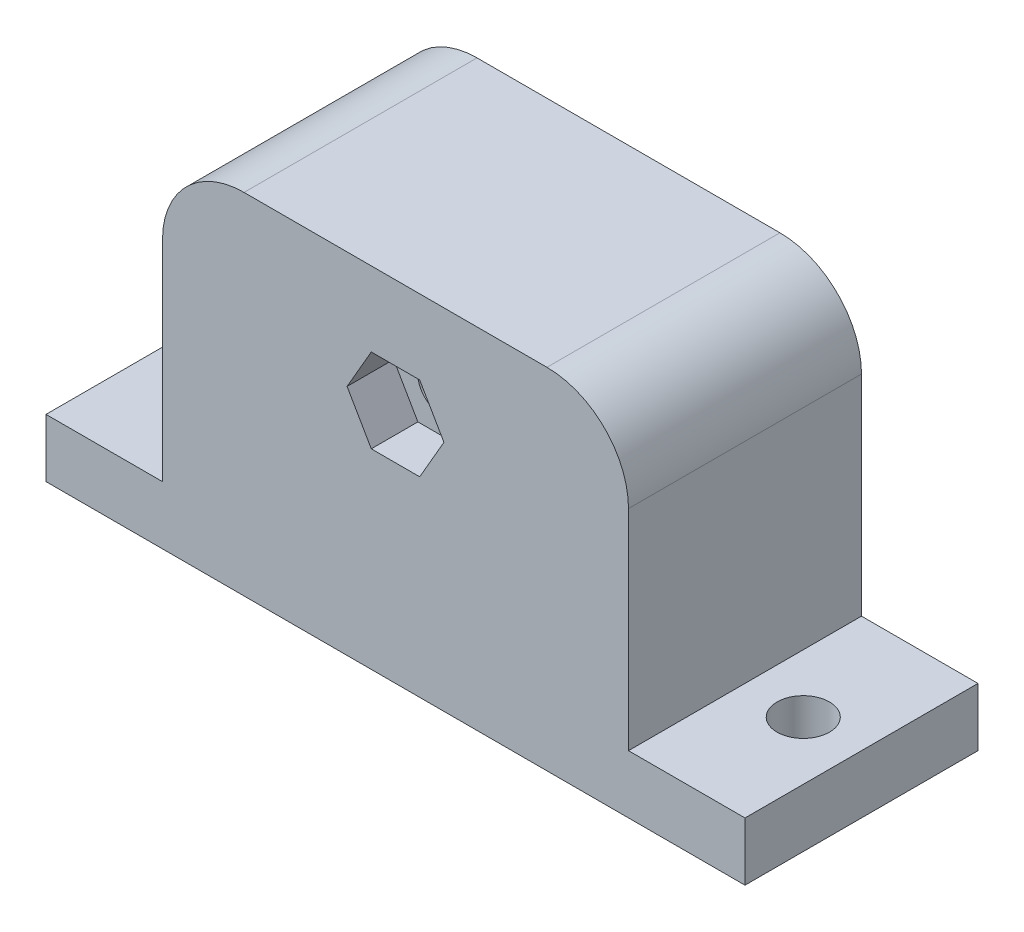
ISO-10303-21;
HEADER;
FILE_DESCRIPTION(('STEP AP214'),'2;1');
FILE_NAME('part.step','',(''),(''),'','','');
FILE_SCHEMA(('AUTOMOTIVE_DESIGN { 1 0 10303 214 1 1 1 1 }'));
ENDSEC;
DATA;
#1=APPLICATION_CONTEXT('core data for automotive mechanical design processes');
#2=APPLICATION_PROTOCOL_DEFINITION('international standard','automotive_design',2000,#1);
#3=PRODUCT_CONTEXT('',#1,'mechanical');
#4=PRODUCT('Part','Part','',(#3));
#5=PRODUCT_RELATED_PRODUCT_CATEGORY('part','',(#4));
#6=PRODUCT_DEFINITION_FORMATION('','',#4);
#7=PRODUCT_DEFINITION_CONTEXT('part definition',#1,'design');
#8=PRODUCT_DEFINITION('design','',#6,#7);
#9=PRODUCT_DEFINITION_SHAPE('','',#8);
#10=(LENGTH_UNIT() NAMED_UNIT(*) SI_UNIT(.MILLI.,.METRE.));
#11=(NAMED_UNIT(*) PLANE_ANGLE_UNIT() SI_UNIT($,.RADIAN.));
#12=(NAMED_UNIT(*) SI_UNIT($,.STERADIAN.) SOLID_ANGLE_UNIT());
#13=UNCERTAINTY_MEASURE_WITH_UNIT(LENGTH_MEASURE(1.E-05),#10,'distance_accuracy_value','');
#14=(GEOMETRIC_REPRESENTATION_CONTEXT(3) GLOBAL_UNCERTAINTY_ASSIGNED_CONTEXT((#13)) GLOBAL_UNIT_ASSIGNED_CONTEXT((#10,
#11,#12)) REPRESENTATION_CONTEXT('',''));
#15=CARTESIAN_POINT('',(0.,0.,0.));
#16=DIRECTION('',(0.,0.,1.));
#17=DIRECTION('',(1.,0.,0.));
#18=AXIS2_PLACEMENT_3D('',#15,#16,#17);
#19=CARTESIAN_POINT('',(0.,20.,10.));
#20=DIRECTION('',(0.,0.,-1.));
#21=DIRECTION('',(-1.,0.,0.));
#22=AXIS2_PLACEMENT_3D('',#19,#20,#21);
#23=CYLINDRICAL_SURFACE('',#22,2.1);
#24=CARTESIAN_POINT('',(0.,20.,-5.));
#25=DIRECTION('',(0.,0.,-1.));
#26=DIRECTION('',(-1.,0.,0.));
#27=AXIS2_PLACEMENT_3D('',#24,#25,#26);
#28=CIRCLE('',#27,2.1);
#29=CARTESIAN_POINT('',(-2.1,20.,-5.));
#30=VERTEX_POINT('',#29);
#31=EDGE_CURVE('E234',#30,#30,#28,.F.);
#32=ORIENTED_EDGE('',*,*,#31,.F.);
#33=EDGE_LOOP('',(#32));
#34=FACE_BOUND('',#33,.T.);
#35=CARTESIAN_POINT('',(0.,20.,6.));
#36=DIRECTION('',(0.,0.,1.));
#37=DIRECTION('',(1.,0.,0.));
#38=AXIS2_PLACEMENT_3D('',#35,#36,#37);
#39=CIRCLE('',#38,2.1);
#40=CARTESIAN_POINT('',(2.1,20.,6.));
#41=VERTEX_POINT('',#40);
#42=EDGE_CURVE('E218',#41,#41,#39,.F.);
#43=ORIENTED_EDGE('',*,*,#42,.F.);
#44=EDGE_LOOP('',(#43));
#45=FACE_BOUND('',#44,.T.);
#46=ADVANCED_FACE('F38',(#34,#45),#23,.F.);
#47=CARTESIAN_POINT('',(0.,5.,0.));
#48=DIRECTION('',(0.,-1.,0.));
#49=DIRECTION('',(0.,0.,-1.));
#50=AXIS2_PLACEMENT_3D('',#47,#48,#49);
#51=PLANE('',#50);
#52=CARTESIAN_POINT('',(-25.,5.,0.));
#53=DIRECTION('',(0.,1.,0.));
#54=DIRECTION('',(0.,0.,1.));
#55=AXIS2_PLACEMENT_3D('',#52,#53,#54);
#56=CIRCLE('',#55,2.25);
#57=CARTESIAN_POINT('',(-25.,5.,2.25));
#58=VERTEX_POINT('',#57);
#59=EDGE_CURVE('E276',#58,#58,#56,.T.);
#60=ORIENTED_EDGE('',*,*,#59,.F.);
#61=EDGE_LOOP('',(#60));
#62=FACE_BOUND('',#61,.T.);
#63=DIRECTION('',(0.,0.,1.));
#64=VECTOR('',#63,1.);
#65=CARTESIAN_POINT('',(-20.,5.,-10.));
#66=LINE('',#65,#64);
#67=CARTESIAN_POINT('',(-20.,5.,-10.));
#68=VERTEX_POINT('',#67);
#69=CARTESIAN_POINT('',(-20.,5.,10.));
#70=VERTEX_POINT('',#69);
#71=EDGE_CURVE('E249',#68,#70,#66,.T.);
#72=ORIENTED_EDGE('',*,*,#71,.F.);
#73=DIRECTION('',(-1.,0.,0.));
#74=VECTOR('',#73,1.);
#75=CARTESIAN_POINT('',(-30.,5.,-10.));
#76=LINE('',#75,#74);
#77=CARTESIAN_POINT('',(-30.,5.,-10.));
#78=VERTEX_POINT('',#77);
#79=EDGE_CURVE('E288',#68,#78,#76,.T.);
#80=ORIENTED_EDGE('',*,*,#79,.T.);
#81=DIRECTION('',(0.,0.,1.));
#82=VECTOR('',#81,1.);
#83=CARTESIAN_POINT('',(-30.,5.,10.));
#84=LINE('',#83,#82);
#85=CARTESIAN_POINT('',(-30.,5.,10.));
#86=VERTEX_POINT('',#85);
#87=EDGE_CURVE('E294',#78,#86,#84,.T.);
#88=ORIENTED_EDGE('',*,*,#87,.T.);
#89=DIRECTION('',(1.,0.,0.));
#90=VECTOR('',#89,1.);
#91=CARTESIAN_POINT('',(-30.,5.,10.));
#92=LINE('',#91,#90);
#93=EDGE_CURVE('E298',#86,#70,#92,.T.);
#94=ORIENTED_EDGE('',*,*,#93,.T.);
#95=EDGE_LOOP('',(#72,#80,#88,#94));
#96=FACE_BOUND('',#95,.T.);
#97=ADVANCED_FACE('F369',(#62,#96),#51,.F.);
#98=CARTESIAN_POINT('',(25.,5.,0.));
#99=DIRECTION('',(0.,1.,0.));
#100=DIRECTION('',(0.,0.,1.));
#101=AXIS2_PLACEMENT_3D('',#98,#99,#100);
#102=CIRCLE('',#101,2.25);
#103=CARTESIAN_POINT('',(25.,5.,2.25));
#104=VERTEX_POINT('',#103);
#105=EDGE_CURVE('E268',#104,#104,#102,.T.);
#106=ORIENTED_EDGE('',*,*,#105,.F.);
#107=EDGE_LOOP('',(#106));
#108=FACE_BOUND('',#107,.T.);
#109=DIRECTION('',(0.,0.,-1.));
#110=VECTOR('',#109,1.);
#111=CARTESIAN_POINT('',(20.,5.,-10.));
#112=LINE('',#111,#110);
#113=CARTESIAN_POINT('',(20.,5.,10.));
#114=VERTEX_POINT('',#113);
#115=CARTESIAN_POINT('',(20.,5.,-10.));
#116=VERTEX_POINT('',#115);
#117=EDGE_CURVE('E244',#114,#116,#112,.T.);
#118=ORIENTED_EDGE('',*,*,#117,.F.);
#119=CARTESIAN_POINT('',(30.,5.,10.));
#120=VERTEX_POINT('',#119);
#121=EDGE_CURVE('E297',#114,#120,#92,.T.);
#122=ORIENTED_EDGE('',*,*,#121,.T.);
#123=DIRECTION('',(0.,0.,-1.));
#124=VECTOR('',#123,1.);
#125=CARTESIAN_POINT('',(30.,5.,10.));
#126=LINE('',#125,#124);
#127=CARTESIAN_POINT('',(30.,5.,-10.));
#128=VERTEX_POINT('',#127);
#129=EDGE_CURVE('E284',#120,#128,#126,.T.);
#130=ORIENTED_EDGE('',*,*,#129,.T.);
#131=EDGE_CURVE('E290',#128,#116,#76,.T.);
#132=ORIENTED_EDGE('',*,*,#131,.T.);
#133=EDGE_LOOP('',(#118,#122,#130,#132));
#134=FACE_BOUND('',#133,.T.);
#135=ADVANCED_FACE('F378',(#108,#134),#51,.F.);
#136=CARTESIAN_POINT('',(0.,0.,0.));
#137=DIRECTION('',(0.,-1.,0.));
#138=DIRECTION('',(0.,0.,-1.));
#139=AXIS2_PLACEMENT_3D('',#136,#137,#138);
#140=PLANE('',#139);
#141=CARTESIAN_POINT('',(-25.,0.,0.));
#142=DIRECTION('',(0.,1.,0.));
#143=DIRECTION('',(0.,0.,1.));
#144=AXIS2_PLACEMENT_3D('',#141,#142,#143);
#145=CIRCLE('',#144,2.25);
#146=CARTESIAN_POINT('',(-25.,0.,2.25));
#147=VERTEX_POINT('',#146);
#148=EDGE_CURVE('E272',#147,#147,#145,.T.);
#149=ORIENTED_EDGE('',*,*,#148,.T.);
#150=EDGE_LOOP('',(#149));
#151=FACE_BOUND('',#150,.T.);
#152=DIRECTION('',(0.,0.,-1.));
#153=VECTOR('',#152,1.);
#154=CARTESIAN_POINT('',(30.,0.,10.));
#155=LINE('',#154,#153);
#156=CARTESIAN_POINT('',(30.,0.,10.));
#157=VERTEX_POINT('',#156);
#158=CARTESIAN_POINT('',(30.,0.,-10.));
#159=VERTEX_POINT('',#158);
#160=EDGE_CURVE('E280',#157,#159,#155,.T.);
#161=ORIENTED_EDGE('',*,*,#160,.F.);
#162=DIRECTION('',(1.,0.,0.));
#163=VECTOR('',#162,1.);
#164=CARTESIAN_POINT('',(-30.,0.,10.));
#165=LINE('',#164,#163);
#166=CARTESIAN_POINT('',(-30.,0.,10.));
#167=VERTEX_POINT('',#166);
#168=EDGE_CURVE('E289',#167,#157,#165,.T.);
#169=ORIENTED_EDGE('',*,*,#168,.F.);
#170=DIRECTION('',(0.,0.,1.));
#171=VECTOR('',#170,1.);
#172=CARTESIAN_POINT('',(-30.,0.,10.));
#173=LINE('',#172,#171);
#174=CARTESIAN_POINT('',(-30.,0.,-10.));
#175=VERTEX_POINT('',#174);
#176=EDGE_CURVE('E309',#175,#167,#173,.T.);
#177=ORIENTED_EDGE('',*,*,#176,.F.);
#178=DIRECTION('',(-1.,0.,0.));
#179=VECTOR('',#178,1.);
#180=CARTESIAN_POINT('',(-30.,0.,-10.));
#181=LINE('',#180,#179);
#182=EDGE_CURVE('E306',#159,#175,#181,.T.);
#183=ORIENTED_EDGE('',*,*,#182,.F.);
#184=EDGE_LOOP('',(#161,#169,#177,#183));
#185=FACE_BOUND('',#184,.T.);
#186=CARTESIAN_POINT('',(25.,0.,0.));
#187=DIRECTION('',(0.,1.,0.));
#188=DIRECTION('',(0.,0.,1.));
#189=AXIS2_PLACEMENT_3D('',#186,#187,#188);
#190=CIRCLE('',#189,2.25);
#191=CARTESIAN_POINT('',(25.,0.,2.25));
#192=VERTEX_POINT('',#191);
#193=EDGE_CURVE('E267',#192,#192,#190,.T.);
#194=ORIENTED_EDGE('',*,*,#193,.T.);
#195=EDGE_LOOP('',(#194));
#196=FACE_BOUND('',#195,.T.);
#197=ADVANCED_FACE('F426',(#151,#185,#196),#140,.T.);
#198=CARTESIAN_POINT('',(30.,5.,10.));
#199=DIRECTION('',(-1.,0.,0.));
#200=DIRECTION('',(0.,0.,1.));
#201=AXIS2_PLACEMENT_3D('',#198,#199,#200);
#202=PLANE('',#201);
#203=ORIENTED_EDGE('',*,*,#160,.T.);
#204=DIRECTION('',(0.,-1.,0.));
#205=VECTOR('',#204,1.);
#206=CARTESIAN_POINT('',(30.,5.,-10.));
#207=LINE('',#206,#205);
#208=EDGE_CURVE('E325',#128,#159,#207,.T.);
#209=ORIENTED_EDGE('',*,*,#208,.F.);
#210=ORIENTED_EDGE('',*,*,#129,.F.);
#211=DIRECTION('',(0.,-1.,0.));
#212=VECTOR('',#211,1.);
#213=CARTESIAN_POINT('',(30.,5.,10.));
#214=LINE('',#213,#212);
#215=EDGE_CURVE('E302',#120,#157,#214,.T.);
#216=ORIENTED_EDGE('',*,*,#215,.T.);
#217=EDGE_LOOP('',(#203,#209,#210,#216));
#218=FACE_BOUND('',#217,.T.);
#219=ADVANCED_FACE('F385',(#218),#202,.F.);
#220=CARTESIAN_POINT('',(-30.,5.,-10.));
#221=DIRECTION('',(0.,0.,1.));
#222=DIRECTION('',(1.,0.,0.));
#223=AXIS2_PLACEMENT_3D('',#220,#221,#222);
#224=PLANE('',#223);
#225=CARTESIAN_POINT('',(0.,20.,-10.));
#226=DIRECTION('',(0.,0.,-1.));
#227=DIRECTION('',(-1.,0.,0.));
#228=AXIS2_PLACEMENT_3D('',#225,#226,#227);
#229=CIRCLE('',#228,3.75);
#230=CARTESIAN_POINT('',(-3.75,20.,-10.));
#231=VERTEX_POINT('',#230);
#232=EDGE_CURVE('E235',#231,#231,#229,.T.);
#233=ORIENTED_EDGE('',*,*,#232,.F.);
#234=EDGE_LOOP('',(#233));
#235=FACE_BOUND('',#234,.T.);
#236=DIRECTION('',(0.,-1.,0.));
#237=VECTOR('',#236,1.);
#238=CARTESIAN_POINT('',(-20.,30.,-10.));
#239=LINE('',#238,#237);
#240=CARTESIAN_POINT('',(-20.,23.,-10.));
#241=VERTEX_POINT('',#240);
#242=EDGE_CURVE('E248',#241,#68,#239,.T.);
#243=ORIENTED_EDGE('',*,*,#242,.F.);
#244=CARTESIAN_POINT('',(-13.,23.,-10.));
#245=DIRECTION('',(0.,0.,1.));
#246=DIRECTION('',(1.,0.,0.));
#247=AXIS2_PLACEMENT_3D('',#244,#245,#246);
#248=CIRCLE('',#247,7.);
#249=CARTESIAN_POINT('',(-13.,30.,-10.));
#250=VERTEX_POINT('',#249);
#251=EDGE_CURVE('E47',#241,#250,#248,.F.);
#252=ORIENTED_EDGE('',*,*,#251,.T.);
#253=DIRECTION('',(-1.,0.,0.));
#254=VECTOR('',#253,1.);
#255=CARTESIAN_POINT('',(-20.,30.,-10.));
#256=LINE('',#255,#254);
#257=CARTESIAN_POINT('',(13.,30.,-10.));
#258=VERTEX_POINT('',#257);
#259=EDGE_CURVE('E243',#258,#250,#256,.T.);
#260=ORIENTED_EDGE('',*,*,#259,.F.);
#261=CARTESIAN_POINT('',(13.,23.,-10.));
#262=DIRECTION('',(0.,0.,1.));
#263=DIRECTION('',(1.,0.,0.));
#264=AXIS2_PLACEMENT_3D('',#261,#262,#263);
#265=CIRCLE('',#264,7.);
#266=CARTESIAN_POINT('',(20.,23.,-10.));
#267=VERTEX_POINT('',#266);
#268=EDGE_CURVE('E54',#258,#267,#265,.F.);
#269=ORIENTED_EDGE('',*,*,#268,.T.);
#270=DIRECTION('',(0.,-1.,0.));
#271=VECTOR('',#270,1.);
#272=CARTESIAN_POINT('',(20.,30.,-10.));
#273=LINE('',#272,#271);
#274=EDGE_CURVE('E258',#267,#116,#273,.T.);
#275=ORIENTED_EDGE('',*,*,#274,.T.);
#276=ORIENTED_EDGE('',*,*,#131,.F.);
#277=ORIENTED_EDGE('',*,*,#208,.T.);
#278=ORIENTED_EDGE('',*,*,#182,.T.);
#279=DIRECTION('',(0.,-1.,0.));
#280=VECTOR('',#279,1.);
#281=CARTESIAN_POINT('',(-30.,5.,-10.));
#282=LINE('',#281,#280);
#283=EDGE_CURVE('E321',#78,#175,#282,.T.);
#284=ORIENTED_EDGE('',*,*,#283,.F.);
#285=ORIENTED_EDGE('',*,*,#79,.F.);
#286=EDGE_LOOP('',(#243,#252,#260,#269,#275,#276,#277,#278,#284,#285));
#287=FACE_BOUND('',#286,.T.);
#288=ADVANCED_FACE('F354',(#235,#287),#224,.F.);
#289=CARTESIAN_POINT('',(-30.,5.,10.));
#290=DIRECTION('',(1.,0.,0.));
#291=DIRECTION('',(0.,0.,-1.));
#292=AXIS2_PLACEMENT_3D('',#289,#290,#291);
#293=PLANE('',#292);
#294=ORIENTED_EDGE('',*,*,#176,.T.);
#295=DIRECTION('',(0.,-1.,0.));
#296=VECTOR('',#295,1.);
#297=CARTESIAN_POINT('',(-30.,5.,10.));
#298=LINE('',#297,#296);
#299=EDGE_CURVE('E317',#86,#167,#298,.T.);
#300=ORIENTED_EDGE('',*,*,#299,.F.);
#301=ORIENTED_EDGE('',*,*,#87,.F.);
#302=ORIENTED_EDGE('',*,*,#283,.T.);
#303=EDGE_LOOP('',(#294,#300,#301,#302));
#304=FACE_BOUND('',#303,.T.);
#305=ADVANCED_FACE('F432',(#304),#293,.F.);
#306=CARTESIAN_POINT('',(-30.,5.,10.));
#307=DIRECTION('',(0.,0.,-1.));
#308=DIRECTION('',(-1.,0.,0.));
#309=AXIS2_PLACEMENT_3D('',#306,#307,#308);
#310=PLANE('',#309);
#311=DIRECTION('',(-1.,0.,0.));
#312=VECTOR('',#311,1.);
#313=CARTESIAN_POINT('',(2.07846096908266,23.6,10.));
#314=LINE('',#313,#312);
#315=CARTESIAN_POINT('',(2.07846096908266,23.6,10.));
#316=VERTEX_POINT('',#315);
#317=CARTESIAN_POINT('',(-2.07846096908265,23.6,10.));
#318=VERTEX_POINT('',#317);
#319=EDGE_CURVE('E201',#316,#318,#314,.T.);
#320=ORIENTED_EDGE('',*,*,#319,.F.);
#321=DIRECTION('',(-0.5,0.866025403784439,0.));
#322=VECTOR('',#321,1.);
#323=CARTESIAN_POINT('',(4.15692193816531,20.,10.));
#324=LINE('',#323,#322);
#325=CARTESIAN_POINT('',(4.15692193816531,20.,10.));
#326=VERTEX_POINT('',#325);
#327=EDGE_CURVE('E159',#326,#316,#324,.T.);
#328=ORIENTED_EDGE('',*,*,#327,.F.);
#329=DIRECTION('',(0.5,0.866025403784438,0.));
#330=VECTOR('',#329,1.);
#331=CARTESIAN_POINT('',(2.07846096908265,16.4,10.));
#332=LINE('',#331,#330);
#333=CARTESIAN_POINT('',(2.07846096908265,16.4,10.));
#334=VERTEX_POINT('',#333);
#335=EDGE_CURVE('E181',#334,#326,#332,.T.);
#336=ORIENTED_EDGE('',*,*,#335,.F.);
#337=DIRECTION('',(1.,0.,0.));
#338=VECTOR('',#337,1.);
#339=CARTESIAN_POINT('',(-2.07846096908265,16.4,10.));
#340=LINE('',#339,#338);
#341=CARTESIAN_POINT('',(-2.07846096908265,16.4,10.));
#342=VERTEX_POINT('',#341);
#343=EDGE_CURVE('E185',#342,#334,#340,.T.);
#344=ORIENTED_EDGE('',*,*,#343,.F.);
#345=DIRECTION('',(0.5,-0.866025403784439,0.));
#346=VECTOR('',#345,1.);
#347=CARTESIAN_POINT('',(-4.15692193816531,20.,10.));
#348=LINE('',#347,#346);
#349=CARTESIAN_POINT('',(-4.15692193816531,20.,10.));
#350=VERTEX_POINT('',#349);
#351=EDGE_CURVE('E208',#350,#342,#348,.T.);
#352=ORIENTED_EDGE('',*,*,#351,.F.);
#353=DIRECTION('',(-0.5,-0.866025403784439,0.));
#354=VECTOR('',#353,1.);
#355=CARTESIAN_POINT('',(-2.07846096908265,23.6,10.));
#356=LINE('',#355,#354);
#357=EDGE_CURVE('E204',#318,#350,#356,.T.);
#358=ORIENTED_EDGE('',*,*,#357,.F.);
#359=EDGE_LOOP('',(#320,#328,#336,#344,#352,#358));
#360=FACE_BOUND('',#359,.T.);
#361=DIRECTION('',(1.,0.,0.));
#362=VECTOR('',#361,1.);
#363=CARTESIAN_POINT('',(-20.,30.,10.));
#364=LINE('',#363,#362);
#365=CARTESIAN_POINT('',(-13.,30.,10.));
#366=VERTEX_POINT('',#365);
#367=CARTESIAN_POINT('',(13.,30.,10.));
#368=VERTEX_POINT('',#367);
#369=EDGE_CURVE('E239',#366,#368,#364,.T.);
#370=ORIENTED_EDGE('',*,*,#369,.F.);
#371=CARTESIAN_POINT('',(-13.,23.,10.));
#372=DIRECTION('',(0.,0.,-1.));
#373=DIRECTION('',(-1.,0.,0.));
#374=AXIS2_PLACEMENT_3D('',#371,#372,#373);
#375=CIRCLE('',#374,7.);
#376=CARTESIAN_POINT('',(-20.,23.,10.));
#377=VERTEX_POINT('',#376);
#378=EDGE_CURVE('E346',#366,#377,#375,.F.);
#379=ORIENTED_EDGE('',*,*,#378,.T.);
#380=DIRECTION('',(0.,-1.,0.));
#381=VECTOR('',#380,1.);
#382=CARTESIAN_POINT('',(-20.,30.,10.));
#383=LINE('',#382,#381);
#384=EDGE_CURVE('E264',#377,#70,#383,.T.);
#385=ORIENTED_EDGE('',*,*,#384,.T.);
#386=ORIENTED_EDGE('',*,*,#93,.F.);
#387=ORIENTED_EDGE('',*,*,#299,.T.);
#388=ORIENTED_EDGE('',*,*,#168,.T.);
#389=ORIENTED_EDGE('',*,*,#215,.F.);
#390=ORIENTED_EDGE('',*,*,#121,.F.);
#391=DIRECTION('',(0.,-1.,0.));
#392=VECTOR('',#391,1.);
#393=CARTESIAN_POINT('',(20.,30.,10.));
#394=LINE('',#393,#392);
#395=CARTESIAN_POINT('',(20.,23.,10.));
#396=VERTEX_POINT('',#395);
#397=EDGE_CURVE('E261',#396,#114,#394,.T.);
#398=ORIENTED_EDGE('',*,*,#397,.F.);
#399=CARTESIAN_POINT('',(13.,23.,10.));
#400=DIRECTION('',(0.,0.,-1.));
#401=DIRECTION('',(-1.,0.,0.));
#402=AXIS2_PLACEMENT_3D('',#399,#400,#401);
#403=CIRCLE('',#402,7.);
#404=EDGE_CURVE('E343',#396,#368,#403,.F.);
#405=ORIENTED_EDGE('',*,*,#404,.T.);
#406=EDGE_LOOP('',(#370,#379,#385,#386,#387,#388,#389,#390,#398,#405));
#407=FACE_BOUND('',#406,.T.);
#408=ADVANCED_FACE('F364',(#360,#407),#310,.F.);
#409=CARTESIAN_POINT('',(-25.,5.,0.));
#410=DIRECTION('',(0.,-1.,0.));
#411=DIRECTION('',(0.,0.,-1.));
#412=AXIS2_PLACEMENT_3D('',#409,#410,#411);
#413=CYLINDRICAL_SURFACE('',#412,2.25);
#414=ORIENTED_EDGE('',*,*,#59,.T.);
#415=EDGE_LOOP('',(#414));
#416=FACE_BOUND('',#415,.T.);
#417=ORIENTED_EDGE('',*,*,#148,.F.);
#418=EDGE_LOOP('',(#417));
#419=FACE_BOUND('',#418,.T.);
#420=ADVANCED_FACE('F421',(#416,#419),#413,.F.);
#421=CARTESIAN_POINT('',(25.,5.,0.));
#422=DIRECTION('',(0.,-1.,0.));
#423=DIRECTION('',(0.,0.,-1.));
#424=AXIS2_PLACEMENT_3D('',#421,#422,#423);
#425=CYLINDRICAL_SURFACE('',#424,2.25);
#426=ORIENTED_EDGE('',*,*,#105,.T.);
#427=EDGE_LOOP('',(#426));
#428=FACE_BOUND('',#427,.T.);
#429=ORIENTED_EDGE('',*,*,#193,.F.);
#430=EDGE_LOOP('',(#429));
#431=FACE_BOUND('',#430,.T.);
#432=ADVANCED_FACE('F418',(#428,#431),#425,.F.);
#433=CARTESIAN_POINT('',(-20.,30.,-10.));
#434=DIRECTION('',(1.,0.,0.));
#435=DIRECTION('',(0.,0.,-1.));
#436=AXIS2_PLACEMENT_3D('',#433,#434,#435);
#437=PLANE('',#436);
#438=ORIENTED_EDGE('',*,*,#384,.F.);
#439=DIRECTION('',(0.,0.,1.));
#440=VECTOR('',#439,1.);
#441=CARTESIAN_POINT('',(-20.,23.,-10.));
#442=LINE('',#441,#440);
#443=EDGE_CURVE('E62',#377,#241,#442,.F.);
#444=ORIENTED_EDGE('',*,*,#443,.T.);
#445=ORIENTED_EDGE('',*,*,#242,.T.);
#446=ORIENTED_EDGE('',*,*,#71,.T.);
#447=EDGE_LOOP('',(#438,#444,#445,#446));
#448=FACE_BOUND('',#447,.T.);
#449=ADVANCED_FACE('F366',(#448),#437,.F.);
#450=CARTESIAN_POINT('',(20.,30.,-10.));
#451=DIRECTION('',(-1.,0.,0.));
#452=DIRECTION('',(0.,0.,1.));
#453=AXIS2_PLACEMENT_3D('',#450,#451,#452);
#454=PLANE('',#453);
#455=ORIENTED_EDGE('',*,*,#274,.F.);
#456=DIRECTION('',(0.,0.,-1.));
#457=VECTOR('',#456,1.);
#458=CARTESIAN_POINT('',(20.,23.,10.));
#459=LINE('',#458,#457);
#460=EDGE_CURVE('E11',#267,#396,#459,.F.);
#461=ORIENTED_EDGE('',*,*,#460,.T.);
#462=ORIENTED_EDGE('',*,*,#397,.T.);
#463=ORIENTED_EDGE('',*,*,#117,.T.);
#464=EDGE_LOOP('',(#455,#461,#462,#463));
#465=FACE_BOUND('',#464,.T.);
#466=ADVANCED_FACE('F387',(#465),#454,.F.);
#467=CARTESIAN_POINT('',(0.,30.,0.));
#468=DIRECTION('',(0.,1.,0.));
#469=DIRECTION('',(0.,0.,1.));
#470=AXIS2_PLACEMENT_3D('',#467,#468,#469);
#471=PLANE('',#470);
#472=ORIENTED_EDGE('',*,*,#259,.T.);
#473=DIRECTION('',(0.,0.,1.));
#474=VECTOR('',#473,1.);
#475=CARTESIAN_POINT('',(-13.,30.,10.));
#476=LINE('',#475,#474);
#477=EDGE_CURVE('E339',#250,#366,#476,.T.);
#478=ORIENTED_EDGE('',*,*,#477,.T.);
#479=ORIENTED_EDGE('',*,*,#369,.T.);
#480=DIRECTION('',(0.,0.,-1.));
#481=VECTOR('',#480,1.);
#482=CARTESIAN_POINT('',(13.,30.,-10.));
#483=LINE('',#482,#481);
#484=EDGE_CURVE('E329',#368,#258,#483,.T.);
#485=ORIENTED_EDGE('',*,*,#484,.T.);
#486=EDGE_LOOP('',(#472,#478,#479,#485));
#487=FACE_BOUND('',#486,.T.);
#488=ADVANCED_FACE('F359',(#487),#471,.T.);
#489=CARTESIAN_POINT('',(0.,20.,-5.));
#490=DIRECTION('',(0.,0.,-1.));
#491=DIRECTION('',(-1.,0.,0.));
#492=AXIS2_PLACEMENT_3D('',#489,#490,#491);
#493=PLANE('',#492);
#494=CARTESIAN_POINT('',(0.,20.,-5.));
#495=DIRECTION('',(0.,0.,-1.));
#496=DIRECTION('',(-1.,0.,0.));
#497=AXIS2_PLACEMENT_3D('',#494,#495,#496);
#498=CIRCLE('',#497,3.75);
#499=CARTESIAN_POINT('',(-3.75,20.,-5.));
#500=VERTEX_POINT('',#499);
#501=EDGE_CURVE('E230',#500,#500,#498,.T.);
#502=ORIENTED_EDGE('',*,*,#501,.T.);
#503=EDGE_LOOP('',(#502));
#504=FACE_BOUND('',#503,.T.);
#505=ORIENTED_EDGE('',*,*,#31,.T.);
#506=EDGE_LOOP('',(#505));
#507=FACE_BOUND('',#506,.T.);
#508=ADVANCED_FACE('F413',(#504,#507),#493,.T.);
#509=CARTESIAN_POINT('',(0.,20.,-5.));
#510=DIRECTION('',(0.,0.,-1.));
#511=DIRECTION('',(-1.,0.,0.));
#512=AXIS2_PLACEMENT_3D('',#509,#510,#511);
#513=CYLINDRICAL_SURFACE('',#512,3.75);
#514=ORIENTED_EDGE('',*,*,#501,.F.);
#515=EDGE_LOOP('',(#514));
#516=FACE_BOUND('',#515,.T.);
#517=ORIENTED_EDGE('',*,*,#232,.T.);
#518=EDGE_LOOP('',(#517));
#519=FACE_BOUND('',#518,.T.);
#520=ADVANCED_FACE('F409',(#516,#519),#513,.F.);
#521=CARTESIAN_POINT('',(0.,0.,6.));
#522=DIRECTION('',(0.,0.,1.));
#523=DIRECTION('',(1.,0.,0.));
#524=AXIS2_PLACEMENT_3D('',#521,#522,#523);
#525=PLANE('',#524);
#526=DIRECTION('',(-0.5,0.866025403784439,0.));
#527=VECTOR('',#526,1.);
#528=CARTESIAN_POINT('',(4.15692193816531,20.,6.));
#529=LINE('',#528,#527);
#530=CARTESIAN_POINT('',(4.15692193816531,20.,6.));
#531=VERTEX_POINT('',#530);
#532=CARTESIAN_POINT('',(2.07846096908266,23.6,6.));
#533=VERTEX_POINT('',#532);
#534=EDGE_CURVE('E156',#531,#533,#529,.T.);
#535=ORIENTED_EDGE('',*,*,#534,.T.);
#536=DIRECTION('',(-1.,0.,0.));
#537=VECTOR('',#536,1.);
#538=CARTESIAN_POINT('',(2.07846096908266,23.6,6.));
#539=LINE('',#538,#537);
#540=CARTESIAN_POINT('',(-2.07846096908265,23.6,6.));
#541=VERTEX_POINT('',#540);
#542=EDGE_CURVE('E168',#533,#541,#539,.T.);
#543=ORIENTED_EDGE('',*,*,#542,.T.);
#544=DIRECTION('',(-0.5,-0.866025403784439,0.));
#545=VECTOR('',#544,1.);
#546=CARTESIAN_POINT('',(-2.07846096908265,23.6,6.));
#547=LINE('',#546,#545);
#548=CARTESIAN_POINT('',(-4.15692193816531,20.,6.));
#549=VERTEX_POINT('',#548);
#550=EDGE_CURVE('E174',#541,#549,#547,.T.);
#551=ORIENTED_EDGE('',*,*,#550,.T.);
#552=DIRECTION('',(0.5,-0.866025403784439,0.));
#553=VECTOR('',#552,1.);
#554=CARTESIAN_POINT('',(-4.15692193816531,20.,6.));
#555=LINE('',#554,#553);
#556=CARTESIAN_POINT('',(-2.07846096908265,16.4,6.));
#557=VERTEX_POINT('',#556);
#558=EDGE_CURVE('E190',#549,#557,#555,.T.);
#559=ORIENTED_EDGE('',*,*,#558,.T.);
#560=DIRECTION('',(1.,0.,0.));
#561=VECTOR('',#560,1.);
#562=CARTESIAN_POINT('',(-2.07846096908265,16.4,6.));
#563=LINE('',#562,#561);
#564=CARTESIAN_POINT('',(2.07846096908265,16.4,6.));
#565=VERTEX_POINT('',#564);
#566=EDGE_CURVE('E194',#557,#565,#563,.T.);
#567=ORIENTED_EDGE('',*,*,#566,.T.);
#568=DIRECTION('',(0.5,0.866025403784438,0.));
#569=VECTOR('',#568,1.);
#570=CARTESIAN_POINT('',(2.07846096908265,16.4,6.));
#571=LINE('',#570,#569);
#572=EDGE_CURVE('E165',#565,#531,#571,.T.);
#573=ORIENTED_EDGE('',*,*,#572,.T.);
#574=EDGE_LOOP('',(#535,#543,#551,#559,#567,#573));
#575=FACE_BOUND('',#574,.T.);
#576=ORIENTED_EDGE('',*,*,#42,.T.);
#577=EDGE_LOOP('',(#576));
#578=FACE_BOUND('',#577,.T.);
#579=ADVANCED_FACE('F176',(#575,#578),#525,.T.);
#580=CARTESIAN_POINT('',(4.15692193816531,20.,6.));
#581=DIRECTION('',(0.866025403784439,0.5,0.));
#582=DIRECTION('',(-0.5,0.866025403784439,0.));
#583=AXIS2_PLACEMENT_3D('',#580,#581,#582);
#584=PLANE('',#583);
#585=ORIENTED_EDGE('',*,*,#327,.T.);
#586=DIRECTION('',(0.,0.,1.));
#587=VECTOR('',#586,1.);
#588=CARTESIAN_POINT('',(2.07846096908266,23.6,6.));
#589=LINE('',#588,#587);
#590=EDGE_CURVE('E152',#533,#316,#589,.T.);
#591=ORIENTED_EDGE('',*,*,#590,.F.);
#592=ORIENTED_EDGE('',*,*,#534,.F.);
#593=DIRECTION('',(0.,0.,1.));
#594=VECTOR('',#593,1.);
#595=CARTESIAN_POINT('',(4.15692193816531,20.,6.));
#596=LINE('',#595,#594);
#597=EDGE_CURVE('E215',#531,#326,#596,.T.);
#598=ORIENTED_EDGE('',*,*,#597,.T.);
#599=EDGE_LOOP('',(#585,#591,#592,#598));
#600=FACE_BOUND('',#599,.T.);
#601=ADVANCED_FACE('F154',(#600),#584,.F.);
#602=CARTESIAN_POINT('',(2.07846096908265,16.4,6.));
#603=DIRECTION('',(0.866025403784439,-0.5,0.));
#604=DIRECTION('',(0.5,0.866025403784438,0.));
#605=AXIS2_PLACEMENT_3D('',#602,#603,#604);
#606=PLANE('',#605);
#607=ORIENTED_EDGE('',*,*,#335,.T.);
#608=ORIENTED_EDGE('',*,*,#597,.F.);
#609=ORIENTED_EDGE('',*,*,#572,.F.);
#610=DIRECTION('',(0.,0.,1.));
#611=VECTOR('',#610,1.);
#612=CARTESIAN_POINT('',(2.07846096908265,16.4,6.));
#613=LINE('',#612,#611);
#614=EDGE_CURVE('E219',#565,#334,#613,.T.);
#615=ORIENTED_EDGE('',*,*,#614,.T.);
#616=EDGE_LOOP('',(#607,#608,#609,#615));
#617=FACE_BOUND('',#616,.T.);
#618=ADVANCED_FACE('F531',(#617),#606,.F.);
#619=CARTESIAN_POINT('',(-2.07846096908265,16.4,6.));
#620=DIRECTION('',(0.,-1.,0.));
#621=DIRECTION('',(0.,0.,-1.));
#622=AXIS2_PLACEMENT_3D('',#619,#620,#621);
#623=PLANE('',#622);
#624=ORIENTED_EDGE('',*,*,#343,.T.);
#625=ORIENTED_EDGE('',*,*,#614,.F.);
#626=ORIENTED_EDGE('',*,*,#566,.F.);
#627=DIRECTION('',(0.,0.,1.));
#628=VECTOR('',#627,1.);
#629=CARTESIAN_POINT('',(-2.07846096908265,16.4,6.));
#630=LINE('',#629,#628);
#631=EDGE_CURVE('E222',#557,#342,#630,.T.);
#632=ORIENTED_EDGE('',*,*,#631,.T.);
#633=EDGE_LOOP('',(#624,#625,#626,#632));
#634=FACE_BOUND('',#633,.T.);
#635=ADVANCED_FACE('F523',(#634),#623,.F.);
#636=CARTESIAN_POINT('',(-4.15692193816531,20.,6.));
#637=DIRECTION('',(-0.866025403784439,-0.5,0.));
#638=DIRECTION('',(0.5,-0.866025403784439,0.));
#639=AXIS2_PLACEMENT_3D('',#636,#637,#638);
#640=PLANE('',#639);
#641=ORIENTED_EDGE('',*,*,#351,.T.);
#642=ORIENTED_EDGE('',*,*,#631,.F.);
#643=ORIENTED_EDGE('',*,*,#558,.F.);
#644=DIRECTION('',(0.,0.,1.));
#645=VECTOR('',#644,1.);
#646=CARTESIAN_POINT('',(-4.15692193816531,20.,6.));
#647=LINE('',#646,#645);
#648=EDGE_CURVE('E225',#549,#350,#647,.T.);
#649=ORIENTED_EDGE('',*,*,#648,.T.);
#650=EDGE_LOOP('',(#641,#642,#643,#649));
#651=FACE_BOUND('',#650,.T.);
#652=ADVANCED_FACE('F515',(#651),#640,.F.);
#653=CARTESIAN_POINT('',(-2.07846096908265,23.6,6.));
#654=DIRECTION('',(-0.866025403784439,0.5,0.));
#655=DIRECTION('',(-0.5,-0.866025403784439,0.));
#656=AXIS2_PLACEMENT_3D('',#653,#654,#655);
#657=PLANE('',#656);
#658=ORIENTED_EDGE('',*,*,#357,.T.);
#659=ORIENTED_EDGE('',*,*,#648,.F.);
#660=ORIENTED_EDGE('',*,*,#550,.F.);
#661=DIRECTION('',(0.,0.,1.));
#662=VECTOR('',#661,1.);
#663=CARTESIAN_POINT('',(-2.07846096908265,23.6,6.));
#664=LINE('',#663,#662);
#665=EDGE_CURVE('E164',#541,#318,#664,.T.);
#666=ORIENTED_EDGE('',*,*,#665,.T.);
#667=EDGE_LOOP('',(#658,#659,#660,#666));
#668=FACE_BOUND('',#667,.T.);
#669=ADVANCED_FACE('F509',(#668),#657,.F.);
#670=CARTESIAN_POINT('',(2.07846096908266,23.6,6.));
#671=DIRECTION('',(0.,1.,0.));
#672=DIRECTION('',(0.,0.,1.));
#673=AXIS2_PLACEMENT_3D('',#670,#671,#672);
#674=PLANE('',#673);
#675=ORIENTED_EDGE('',*,*,#319,.T.);
#676=ORIENTED_EDGE('',*,*,#665,.F.);
#677=ORIENTED_EDGE('',*,*,#542,.F.);
#678=ORIENTED_EDGE('',*,*,#590,.T.);
#679=EDGE_LOOP('',(#675,#676,#677,#678));
#680=FACE_BOUND('',#679,.T.);
#681=ADVANCED_FACE('F169',(#680),#674,.F.);
#682=CARTESIAN_POINT('',(-13.,23.,0.));
#683=DIRECTION('',(0.,0.,-1.));
#684=DIRECTION('',(-1.,0.,0.));
#685=AXIS2_PLACEMENT_3D('',#682,#683,#684);
#686=CYLINDRICAL_SURFACE('',#685,7.);
#687=ORIENTED_EDGE('',*,*,#251,.F.);
#688=ORIENTED_EDGE('',*,*,#443,.F.);
#689=ORIENTED_EDGE('',*,*,#378,.F.);
#690=ORIENTED_EDGE('',*,*,#477,.F.);
#691=EDGE_LOOP('',(#687,#688,#689,#690));
#692=FACE_BOUND('',#691,.T.);
#693=ADVANCED_FACE('F362',(#692),#686,.T.);
#694=CARTESIAN_POINT('',(13.,23.,0.));
#695=DIRECTION('',(0.,0.,1.));
#696=DIRECTION('',(1.,0.,0.));
#697=AXIS2_PLACEMENT_3D('',#694,#695,#696);
#698=CYLINDRICAL_SURFACE('',#697,7.);
#699=ORIENTED_EDGE('',*,*,#404,.F.);
#700=ORIENTED_EDGE('',*,*,#460,.F.);
#701=ORIENTED_EDGE('',*,*,#268,.F.);
#702=ORIENTED_EDGE('',*,*,#484,.F.);
#703=EDGE_LOOP('',(#699,#700,#701,#702));
#704=FACE_BOUND('',#703,.T.);
#705=ADVANCED_FACE('F40',(#704),#698,.T.);
#706=CLOSED_SHELL('',(#46,#97,#135,#197,#219,#288,#305,#408,#420,#432,#449,#466,#488,#508,#520,
#579,#601,#618,#635,#652,#669,#681,#693,#705));
#707=MANIFOLD_SOLID_BREP('B2',#706);
#708=ADVANCED_BREP_SHAPE_REPRESENTATION('',(#18,#707),#14);
#709=SHAPE_DEFINITION_REPRESENTATION(#9,#708);
ENDSEC;
END-ISO-10303-21;
